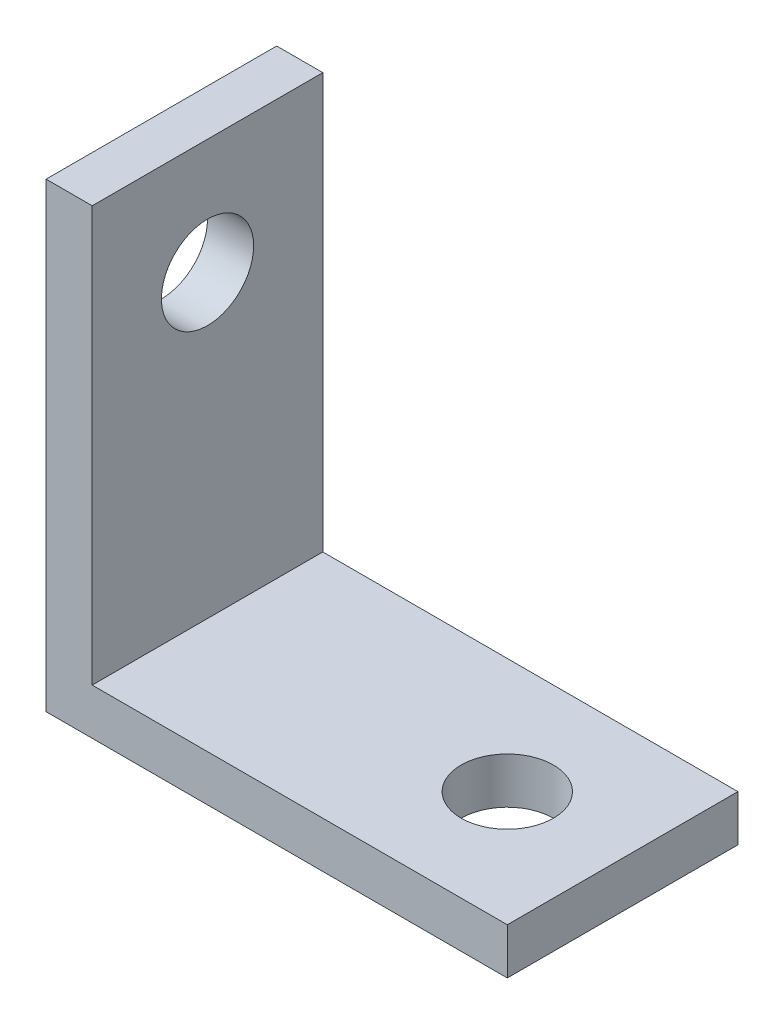
ISO-10303-21;
HEADER;
FILE_DESCRIPTION(('STEP AP214'),'2;1');
FILE_NAME('part.step','',(''),(''),'','','');
FILE_SCHEMA(('AUTOMOTIVE_DESIGN { 1 0 10303 214 1 1 1 1 }'));
ENDSEC;
DATA;
#1=APPLICATION_CONTEXT('core data for automotive mechanical design processes');
#2=APPLICATION_PROTOCOL_DEFINITION('international standard','automotive_design',2000,#1);
#3=PRODUCT_CONTEXT('',#1,'mechanical');
#4=PRODUCT('Part','Part','',(#3));
#5=PRODUCT_RELATED_PRODUCT_CATEGORY('part','',(#4));
#6=PRODUCT_DEFINITION_FORMATION('','',#4);
#7=PRODUCT_DEFINITION_CONTEXT('part definition',#1,'design');
#8=PRODUCT_DEFINITION('design','',#6,#7);
#9=PRODUCT_DEFINITION_SHAPE('','',#8);
#10=(LENGTH_UNIT() NAMED_UNIT(*) SI_UNIT(.MILLI.,.METRE.));
#11=(NAMED_UNIT(*) PLANE_ANGLE_UNIT() SI_UNIT($,.RADIAN.));
#12=(NAMED_UNIT(*) SI_UNIT($,.STERADIAN.) SOLID_ANGLE_UNIT());
#13=UNCERTAINTY_MEASURE_WITH_UNIT(LENGTH_MEASURE(1.E-05),#10,'distance_accuracy_value','');
#14=(GEOMETRIC_REPRESENTATION_CONTEXT(3) GLOBAL_UNCERTAINTY_ASSIGNED_CONTEXT((#13)) GLOBAL_UNIT_ASSIGNED_CONTEXT((#10,
#11,#12)) REPRESENTATION_CONTEXT('',''));
#15=CARTESIAN_POINT('',(0.,0.,0.));
#16=DIRECTION('',(0.,0.,1.));
#17=DIRECTION('',(1.,0.,0.));
#18=AXIS2_PLACEMENT_3D('',#15,#16,#17);
#19=CARTESIAN_POINT('',(-9.84057231720679,-20.8275096404176,10.));
#20=DIRECTION('',(-1.,0.,0.));
#21=DIRECTION('',(0.,0.,1.));
#22=AXIS2_PLACEMENT_3D('',#19,#20,#21);
#23=PLANE('',#22);
#24=CARTESIAN_POINT('',(-9.84057231720679,15.,5.));
#25=DIRECTION('',(1.,0.,0.));
#26=DIRECTION('',(0.,0.,-1.));
#27=AXIS2_PLACEMENT_3D('',#24,#25,#26);
#28=CIRCLE('',#27,2.);
#29=CARTESIAN_POINT('',(-9.84057231720679,15.,3.));
#30=VERTEX_POINT('',#29);
#31=EDGE_CURVE('E151',#30,#30,#28,.T.);
#32=ORIENTED_EDGE('',*,*,#31,.T.);
#33=EDGE_LOOP('',(#32));
#34=FACE_BOUND('',#33,.T.);
#35=DIRECTION('',(0.,1.,0.));
#36=VECTOR('',#35,1.);
#37=CARTESIAN_POINT('',(-9.84057231720679,-20.8275096404176,0.));
#38=LINE('',#37,#36);
#39=CARTESIAN_POINT('',(-9.84057231720679,0.,0.));
#40=VERTEX_POINT('',#39);
#41=CARTESIAN_POINT('',(-9.84057231720679,20.,0.));
#42=VERTEX_POINT('',#41);
#43=EDGE_CURVE('E117',#40,#42,#38,.T.);
#44=ORIENTED_EDGE('',*,*,#43,.F.);
#45=DIRECTION('',(0.,0.,-1.));
#46=VECTOR('',#45,1.);
#47=CARTESIAN_POINT('',(-9.84057231720679,0.,10.));
#48=LINE('',#47,#46);
#49=CARTESIAN_POINT('',(-9.84057231720679,0.,10.));
#50=VERTEX_POINT('',#49);
#51=EDGE_CURVE('E11',#50,#40,#48,.T.);
#52=ORIENTED_EDGE('',*,*,#51,.F.);
#53=DIRECTION('',(0.,1.,0.));
#54=VECTOR('',#53,1.);
#55=CARTESIAN_POINT('',(-9.84057231720679,-20.8275096404176,10.));
#56=LINE('',#55,#54);
#57=CARTESIAN_POINT('',(-9.84057231720679,20.,10.));
#58=VERTEX_POINT('',#57);
#59=EDGE_CURVE('E131',#50,#58,#56,.T.);
#60=ORIENTED_EDGE('',*,*,#59,.T.);
#61=DIRECTION('',(0.,0.,-1.));
#62=VECTOR('',#61,1.);
#63=CARTESIAN_POINT('',(-9.84057231720679,20.,10.));
#64=LINE('',#63,#62);
#65=EDGE_CURVE('E79',#58,#42,#64,.T.);
#66=ORIENTED_EDGE('',*,*,#65,.T.);
#67=EDGE_LOOP('',(#44,#52,#60,#66));
#68=FACE_BOUND('',#67,.T.);
#69=ADVANCED_FACE('F35',(#34,#68),#23,.T.);
#70=CARTESIAN_POINT('',(-3.91520925271064,0.,10.));
#71=DIRECTION('',(0.,1.,0.));
#72=DIRECTION('',(0.,0.,1.));
#73=AXIS2_PLACEMENT_3D('',#70,#71,#72);
#74=PLANE('',#73);
#75=CARTESIAN_POINT('',(5.15942768279321,0.,5.));
#76=DIRECTION('',(0.,1.,0.));
#77=DIRECTION('',(0.,0.,1.));
#78=AXIS2_PLACEMENT_3D('',#75,#76,#77);
#79=CIRCLE('',#78,2.);
#80=CARTESIAN_POINT('',(5.15942768279321,0.,7.));
#81=VERTEX_POINT('',#80);
#82=EDGE_CURVE('E121',#81,#81,#79,.T.);
#83=ORIENTED_EDGE('',*,*,#82,.T.);
#84=EDGE_LOOP('',(#83));
#85=FACE_BOUND('',#84,.T.);
#86=DIRECTION('',(1.,0.,0.));
#87=VECTOR('',#86,1.);
#88=CARTESIAN_POINT('',(-3.91520925271064,0.,0.));
#89=LINE('',#88,#87);
#90=CARTESIAN_POINT('',(10.1594276827932,0.,0.));
#91=VERTEX_POINT('',#90);
#92=EDGE_CURVE('E120',#40,#91,#89,.T.);
#93=ORIENTED_EDGE('',*,*,#92,.T.);
#94=DIRECTION('',(0.,0.,-1.));
#95=VECTOR('',#94,1.);
#96=CARTESIAN_POINT('',(10.1594276827932,0.,10.));
#97=LINE('',#96,#95);
#98=CARTESIAN_POINT('',(10.1594276827932,0.,10.));
#99=VERTEX_POINT('',#98);
#100=EDGE_CURVE('E43',#99,#91,#97,.T.);
#101=ORIENTED_EDGE('',*,*,#100,.F.);
#102=DIRECTION('',(1.,0.,0.));
#103=VECTOR('',#102,1.);
#104=CARTESIAN_POINT('',(-3.91520925271064,0.,10.));
#105=LINE('',#104,#103);
#106=EDGE_CURVE('E112',#50,#99,#105,.T.);
#107=ORIENTED_EDGE('',*,*,#106,.F.);
#108=ORIENTED_EDGE('',*,*,#51,.T.);
#109=EDGE_LOOP('',(#93,#101,#107,#108));
#110=FACE_BOUND('',#109,.T.);
#111=ADVANCED_FACE('F140',(#85,#110),#74,.F.);
#112=CARTESIAN_POINT('',(10.1594276827932,-20.8275096404176,10.));
#113=DIRECTION('',(1.,0.,0.));
#114=DIRECTION('',(0.,1.,0.));
#115=AXIS2_PLACEMENT_3D('',#112,#113,#114);
#116=PLANE('',#115);
#117=DIRECTION('',(0.,-1.,0.));
#118=VECTOR('',#117,1.);
#119=CARTESIAN_POINT('',(10.1594276827932,-20.8275096404176,0.));
#120=LINE('',#119,#118);
#121=CARTESIAN_POINT('',(10.1594276827932,2.,0.));
#122=VERTEX_POINT('',#121);
#123=EDGE_CURVE('E124',#122,#91,#120,.T.);
#124=ORIENTED_EDGE('',*,*,#123,.F.);
#125=DIRECTION('',(0.,0.,-1.));
#126=VECTOR('',#125,1.);
#127=CARTESIAN_POINT('',(10.1594276827932,2.,10.));
#128=LINE('',#127,#126);
#129=CARTESIAN_POINT('',(10.1594276827932,2.,10.));
#130=VERTEX_POINT('',#129);
#131=EDGE_CURVE('E101',#130,#122,#128,.T.);
#132=ORIENTED_EDGE('',*,*,#131,.F.);
#133=DIRECTION('',(0.,-1.,0.));
#134=VECTOR('',#133,1.);
#135=CARTESIAN_POINT('',(10.1594276827932,-20.8275096404176,10.));
#136=LINE('',#135,#134);
#137=EDGE_CURVE('E110',#130,#99,#136,.T.);
#138=ORIENTED_EDGE('',*,*,#137,.T.);
#139=ORIENTED_EDGE('',*,*,#100,.T.);
#140=EDGE_LOOP('',(#124,#132,#138,#139));
#141=FACE_BOUND('',#140,.T.);
#142=ADVANCED_FACE('F137',(#141),#116,.T.);
#143=CARTESIAN_POINT('',(-3.91520925271064,2.,10.));
#144=DIRECTION('',(0.,1.,0.));
#145=DIRECTION('',(0.,0.,1.));
#146=AXIS2_PLACEMENT_3D('',#143,#144,#145);
#147=PLANE('',#146);
#148=CARTESIAN_POINT('',(5.15942768279321,2.,5.));
#149=DIRECTION('',(0.,1.,0.));
#150=DIRECTION('',(0.,0.,1.));
#151=AXIS2_PLACEMENT_3D('',#148,#149,#150);
#152=CIRCLE('',#151,2.);
#153=CARTESIAN_POINT('',(5.15942768279321,2.,7.));
#154=VERTEX_POINT('',#153);
#155=EDGE_CURVE('E148',#154,#154,#152,.T.);
#156=ORIENTED_EDGE('',*,*,#155,.F.);
#157=EDGE_LOOP('',(#156));
#158=FACE_BOUND('',#157,.T.);
#159=DIRECTION('',(1.,0.,0.));
#160=VECTOR('',#159,1.);
#161=CARTESIAN_POINT('',(-3.91520925271064,2.,0.));
#162=LINE('',#161,#160);
#163=CARTESIAN_POINT('',(-7.84057231720679,2.,0.));
#164=VERTEX_POINT('',#163);
#165=EDGE_CURVE('E100',#164,#122,#162,.T.);
#166=ORIENTED_EDGE('',*,*,#165,.F.);
#167=DIRECTION('',(0.,0.,-1.));
#168=VECTOR('',#167,1.);
#169=CARTESIAN_POINT('',(-7.84057231720679,2.,10.));
#170=LINE('',#169,#168);
#171=CARTESIAN_POINT('',(-7.84057231720679,2.,10.));
#172=VERTEX_POINT('',#171);
#173=EDGE_CURVE('E94',#172,#164,#170,.T.);
#174=ORIENTED_EDGE('',*,*,#173,.F.);
#175=DIRECTION('',(1.,0.,0.));
#176=VECTOR('',#175,1.);
#177=CARTESIAN_POINT('',(-3.91520925271064,2.,10.));
#178=LINE('',#177,#176);
#179=EDGE_CURVE('E98',#172,#130,#178,.T.);
#180=ORIENTED_EDGE('',*,*,#179,.T.);
#181=ORIENTED_EDGE('',*,*,#131,.T.);
#182=EDGE_LOOP('',(#166,#174,#180,#181));
#183=FACE_BOUND('',#182,.T.);
#184=ADVANCED_FACE('F96',(#158,#183),#147,.T.);
#185=CARTESIAN_POINT('',(-7.84057231720679,-20.8275096404176,10.));
#186=DIRECTION('',(-1.,0.,0.));
#187=DIRECTION('',(0.,0.,1.));
#188=AXIS2_PLACEMENT_3D('',#185,#186,#187);
#189=PLANE('',#188);
#190=CARTESIAN_POINT('',(-7.84057231720679,15.,5.));
#191=DIRECTION('',(1.,0.,0.));
#192=DIRECTION('',(0.,0.,-1.));
#193=AXIS2_PLACEMENT_3D('',#190,#191,#192);
#194=CIRCLE('',#193,2.);
#195=CARTESIAN_POINT('',(-7.84057231720679,15.,3.));
#196=VERTEX_POINT('',#195);
#197=EDGE_CURVE('E154',#196,#196,#194,.T.);
#198=ORIENTED_EDGE('',*,*,#197,.F.);
#199=EDGE_LOOP('',(#198));
#200=FACE_BOUND('',#199,.T.);
#201=DIRECTION('',(0.,1.,0.));
#202=VECTOR('',#201,1.);
#203=CARTESIAN_POINT('',(-7.84057231720679,-20.8275096404176,0.));
#204=LINE('',#203,#202);
#205=CARTESIAN_POINT('',(-7.84057231720679,20.,0.));
#206=VERTEX_POINT('',#205);
#207=EDGE_CURVE('E72',#164,#206,#204,.T.);
#208=ORIENTED_EDGE('',*,*,#207,.T.);
#209=DIRECTION('',(0.,0.,-1.));
#210=VECTOR('',#209,1.);
#211=CARTESIAN_POINT('',(-7.84057231720679,20.,10.));
#212=LINE('',#211,#210);
#213=CARTESIAN_POINT('',(-7.84057231720679,20.,10.));
#214=VERTEX_POINT('',#213);
#215=EDGE_CURVE('E102',#214,#206,#212,.T.);
#216=ORIENTED_EDGE('',*,*,#215,.F.);
#217=DIRECTION('',(0.,1.,0.));
#218=VECTOR('',#217,1.);
#219=CARTESIAN_POINT('',(-7.84057231720679,-20.8275096404176,10.));
#220=LINE('',#219,#218);
#221=EDGE_CURVE('E104',#172,#214,#220,.T.);
#222=ORIENTED_EDGE('',*,*,#221,.F.);
#223=ORIENTED_EDGE('',*,*,#173,.T.);
#224=EDGE_LOOP('',(#208,#216,#222,#223));
#225=FACE_BOUND('',#224,.T.);
#226=ADVANCED_FACE('F105',(#200,#225),#189,.F.);
#227=CARTESIAN_POINT('',(-3.91520925271064,20.,10.));
#228=DIRECTION('',(0.,-1.,0.));
#229=DIRECTION('',(0.,0.,-1.));
#230=AXIS2_PLACEMENT_3D('',#227,#228,#229);
#231=PLANE('',#230);
#232=DIRECTION('',(-1.,0.,0.));
#233=VECTOR('',#232,1.);
#234=CARTESIAN_POINT('',(-3.91520925271064,20.,0.));
#235=LINE('',#234,#233);
#236=EDGE_CURVE('E129',#206,#42,#235,.T.);
#237=ORIENTED_EDGE('',*,*,#236,.T.);
#238=ORIENTED_EDGE('',*,*,#65,.F.);
#239=DIRECTION('',(-1.,0.,0.));
#240=VECTOR('',#239,1.);
#241=CARTESIAN_POINT('',(-3.91520925271064,20.,10.));
#242=LINE('',#241,#240);
#243=EDGE_CURVE('E51',#214,#58,#242,.T.);
#244=ORIENTED_EDGE('',*,*,#243,.F.);
#245=ORIENTED_EDGE('',*,*,#215,.T.);
#246=EDGE_LOOP('',(#237,#238,#244,#245));
#247=FACE_BOUND('',#246,.T.);
#248=ADVANCED_FACE('F145',(#247),#231,.F.);
#249=CARTESIAN_POINT('',(-3.91520925271064,-20.8275096404176,10.));
#250=DIRECTION('',(0.,0.,1.));
#251=DIRECTION('',(1.,0.,0.));
#252=AXIS2_PLACEMENT_3D('',#249,#250,#251);
#253=PLANE('',#252);
#254=ORIENTED_EDGE('',*,*,#59,.F.);
#255=ORIENTED_EDGE('',*,*,#106,.T.);
#256=ORIENTED_EDGE('',*,*,#137,.F.);
#257=ORIENTED_EDGE('',*,*,#179,.F.);
#258=ORIENTED_EDGE('',*,*,#221,.T.);
#259=ORIENTED_EDGE('',*,*,#243,.T.);
#260=EDGE_LOOP('',(#254,#255,#256,#257,#258,#259));
#261=FACE_BOUND('',#260,.T.);
#262=ADVANCED_FACE('F108',(#261),#253,.T.);
#263=CARTESIAN_POINT('',(-3.91520925271064,-20.8275096404176,0.));
#264=DIRECTION('',(0.,0.,1.));
#265=DIRECTION('',(1.,0.,0.));
#266=AXIS2_PLACEMENT_3D('',#263,#264,#265);
#267=PLANE('',#266);
#268=ORIENTED_EDGE('',*,*,#43,.T.);
#269=ORIENTED_EDGE('',*,*,#236,.F.);
#270=ORIENTED_EDGE('',*,*,#207,.F.);
#271=ORIENTED_EDGE('',*,*,#165,.T.);
#272=ORIENTED_EDGE('',*,*,#123,.T.);
#273=ORIENTED_EDGE('',*,*,#92,.F.);
#274=EDGE_LOOP('',(#268,#269,#270,#271,#272,#273));
#275=FACE_BOUND('',#274,.T.);
#276=ADVANCED_FACE('F142',(#275),#267,.F.);
#277=CARTESIAN_POINT('',(5.15942768279321,0.,5.));
#278=DIRECTION('',(0.,1.,0.));
#279=DIRECTION('',(0.,0.,1.));
#280=AXIS2_PLACEMENT_3D('',#277,#278,#279);
#281=CYLINDRICAL_SURFACE('',#280,2.);
#282=ORIENTED_EDGE('',*,*,#82,.F.);
#283=EDGE_LOOP('',(#282));
#284=FACE_BOUND('',#283,.T.);
#285=ORIENTED_EDGE('',*,*,#155,.T.);
#286=EDGE_LOOP('',(#285));
#287=FACE_BOUND('',#286,.T.);
#288=ADVANCED_FACE('F164',(#284,#287),#281,.F.);
#289=CARTESIAN_POINT('',(-9.84057231720679,15.,5.));
#290=DIRECTION('',(1.,0.,0.));
#291=DIRECTION('',(0.,0.,-1.));
#292=AXIS2_PLACEMENT_3D('',#289,#290,#291);
#293=CYLINDRICAL_SURFACE('',#292,2.);
#294=ORIENTED_EDGE('',*,*,#31,.F.);
#295=EDGE_LOOP('',(#294));
#296=FACE_BOUND('',#295,.T.);
#297=ORIENTED_EDGE('',*,*,#197,.T.);
#298=EDGE_LOOP('',(#297));
#299=FACE_BOUND('',#298,.T.);
#300=ADVANCED_FACE('F161',(#296,#299),#293,.F.);
#301=CLOSED_SHELL('',(#69,#111,#142,#184,#226,#248,#262,#276,#288,#300));
#302=MANIFOLD_SOLID_BREP('B2',#301);
#303=ADVANCED_BREP_SHAPE_REPRESENTATION('',(#18,#302),#14);
#304=SHAPE_DEFINITION_REPRESENTATION(#9,#303);
ENDSEC;
END-ISO-10303-21;
